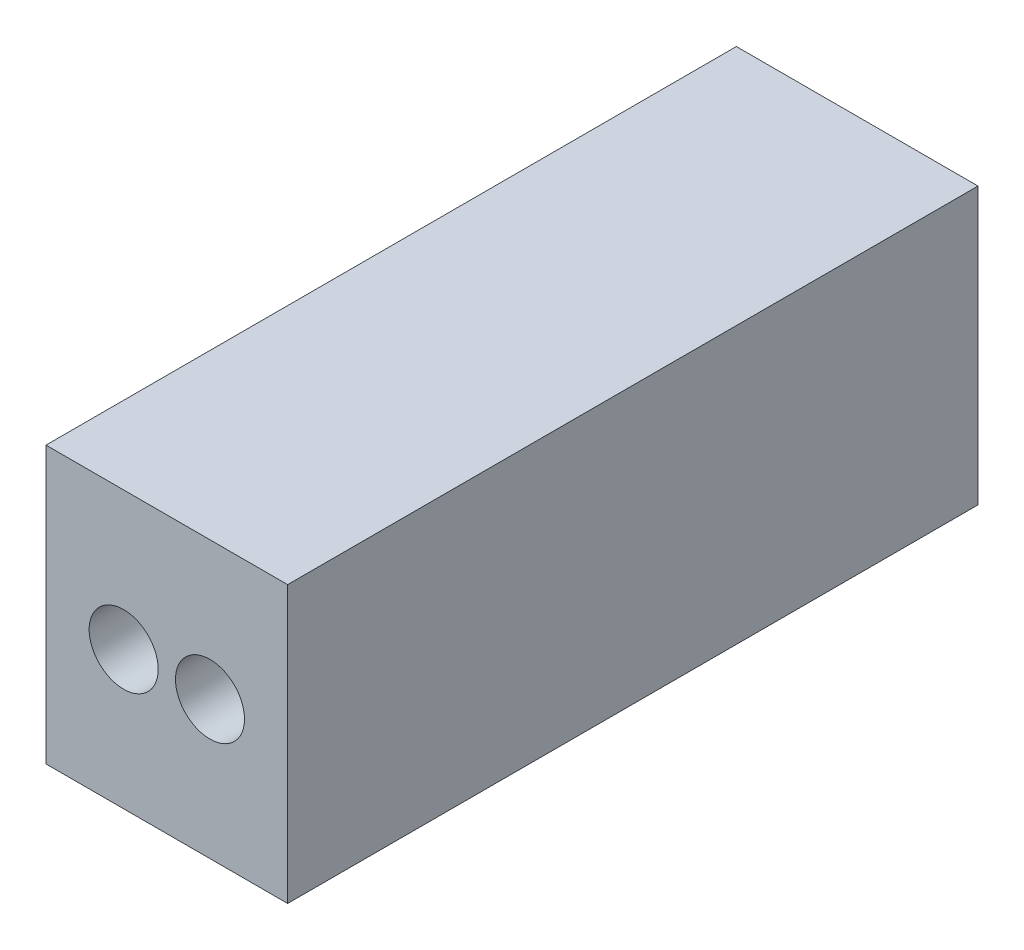
ISO-10303-21;
HEADER;
FILE_DESCRIPTION(('STEP AP214'),'2;1');
FILE_NAME('part.step','',(''),(''),'','','');
FILE_SCHEMA(('AUTOMOTIVE_DESIGN { 1 0 10303 214 1 1 1 1 }'));
ENDSEC;
DATA;
#1=APPLICATION_CONTEXT('core data for automotive mechanical design processes');
#2=APPLICATION_PROTOCOL_DEFINITION('international standard','automotive_design',2000,#1);
#3=PRODUCT_CONTEXT('',#1,'mechanical');
#4=PRODUCT('Part','Part','',(#3));
#5=PRODUCT_RELATED_PRODUCT_CATEGORY('part','',(#4));
#6=PRODUCT_DEFINITION_FORMATION('','',#4);
#7=PRODUCT_DEFINITION_CONTEXT('part definition',#1,'design');
#8=PRODUCT_DEFINITION('design','',#6,#7);
#9=PRODUCT_DEFINITION_SHAPE('','',#8);
#10=(LENGTH_UNIT() NAMED_UNIT(*) SI_UNIT(.MILLI.,.METRE.));
#11=(NAMED_UNIT(*) PLANE_ANGLE_UNIT() SI_UNIT($,.RADIAN.));
#12=(NAMED_UNIT(*) SI_UNIT($,.STERADIAN.) SOLID_ANGLE_UNIT());
#13=UNCERTAINTY_MEASURE_WITH_UNIT(LENGTH_MEASURE(1.E-05),#10,'distance_accuracy_value','');
#14=(GEOMETRIC_REPRESENTATION_CONTEXT(3) GLOBAL_UNCERTAINTY_ASSIGNED_CONTEXT((#13)) GLOBAL_UNIT_ASSIGNED_CONTEXT((#10,
#11,#12)) REPRESENTATION_CONTEXT('',''));
#15=CARTESIAN_POINT('',(0.,0.,0.));
#16=DIRECTION('',(0.,0.,1.));
#17=DIRECTION('',(1.,0.,0.));
#18=AXIS2_PLACEMENT_3D('',#15,#16,#17);
#19=CARTESIAN_POINT('',(0.,0.,10.));
#20=DIRECTION('',(1.,0.,0.));
#21=DIRECTION('',(0.,0.,-1.));
#22=AXIS2_PLACEMENT_3D('',#19,#20,#21);
#23=PLANE('',#22);
#24=DIRECTION('',(0.,-1.,0.));
#25=VECTOR('',#24,1.);
#26=CARTESIAN_POINT('',(0.,0.,0.));
#27=LINE('',#26,#25);
#28=CARTESIAN_POINT('',(0.,4.,0.));
#29=VERTEX_POINT('',#28);
#30=CARTESIAN_POINT('',(0.,0.,0.));
#31=VERTEX_POINT('',#30);
#32=EDGE_CURVE('E99',#29,#31,#27,.T.);
#33=ORIENTED_EDGE('',*,*,#32,.T.);
#34=DIRECTION('',(0.,0.,-1.));
#35=VECTOR('',#34,1.);
#36=CARTESIAN_POINT('',(0.,0.,10.));
#37=LINE('',#36,#35);
#38=CARTESIAN_POINT('',(0.,0.,10.));
#39=VERTEX_POINT('',#38);
#40=EDGE_CURVE('E11',#39,#31,#37,.T.);
#41=ORIENTED_EDGE('',*,*,#40,.F.);
#42=DIRECTION('',(0.,-1.,0.));
#43=VECTOR('',#42,1.);
#44=CARTESIAN_POINT('',(0.,0.,10.));
#45=LINE('',#44,#43);
#46=CARTESIAN_POINT('',(0.,4.,10.));
#47=VERTEX_POINT('',#46);
#48=EDGE_CURVE('E87',#47,#39,#45,.T.);
#49=ORIENTED_EDGE('',*,*,#48,.F.);
#50=DIRECTION('',(0.,0.,-1.));
#51=VECTOR('',#50,1.);
#52=CARTESIAN_POINT('',(0.,4.,10.));
#53=LINE('',#52,#51);
#54=EDGE_CURVE('E95',#47,#29,#53,.T.);
#55=ORIENTED_EDGE('',*,*,#54,.T.);
#56=EDGE_LOOP('',(#33,#41,#49,#55));
#57=FACE_BOUND('',#56,.T.);
#58=ADVANCED_FACE('F36',(#57),#23,.F.);
#59=CARTESIAN_POINT('',(0.,0.,10.));
#60=DIRECTION('',(0.,1.,0.));
#61=DIRECTION('',(0.,0.,1.));
#62=AXIS2_PLACEMENT_3D('',#59,#60,#61);
#63=PLANE('',#62);
#64=DIRECTION('',(1.,0.,0.));
#65=VECTOR('',#64,1.);
#66=CARTESIAN_POINT('',(0.,0.,0.));
#67=LINE('',#66,#65);
#68=CARTESIAN_POINT('',(3.5,0.,0.));
#69=VERTEX_POINT('',#68);
#70=EDGE_CURVE('E91',#31,#69,#67,.T.);
#71=ORIENTED_EDGE('',*,*,#70,.T.);
#72=DIRECTION('',(0.,0.,-1.));
#73=VECTOR('',#72,1.);
#74=CARTESIAN_POINT('',(3.5,0.,10.));
#75=LINE('',#74,#73);
#76=CARTESIAN_POINT('',(3.5,0.,10.));
#77=VERTEX_POINT('',#76);
#78=EDGE_CURVE('E44',#77,#69,#75,.T.);
#79=ORIENTED_EDGE('',*,*,#78,.F.);
#80=DIRECTION('',(1.,0.,0.));
#81=VECTOR('',#80,1.);
#82=CARTESIAN_POINT('',(0.,0.,10.));
#83=LINE('',#82,#81);
#84=EDGE_CURVE('E82',#39,#77,#83,.T.);
#85=ORIENTED_EDGE('',*,*,#84,.F.);
#86=ORIENTED_EDGE('',*,*,#40,.T.);
#87=EDGE_LOOP('',(#71,#79,#85,#86));
#88=FACE_BOUND('',#87,.T.);
#89=ADVANCED_FACE('F90',(#88),#63,.F.);
#90=CARTESIAN_POINT('',(3.5,0.,10.));
#91=DIRECTION('',(-1.,0.,0.));
#92=DIRECTION('',(0.,0.,1.));
#93=AXIS2_PLACEMENT_3D('',#90,#91,#92);
#94=PLANE('',#93);
#95=DIRECTION('',(0.,1.,0.));
#96=VECTOR('',#95,1.);
#97=CARTESIAN_POINT('',(3.5,0.,0.));
#98=LINE('',#97,#96);
#99=CARTESIAN_POINT('',(3.5,4.,0.));
#100=VERTEX_POINT('',#99);
#101=EDGE_CURVE('E69',#69,#100,#98,.T.);
#102=ORIENTED_EDGE('',*,*,#101,.T.);
#103=DIRECTION('',(0.,0.,-1.));
#104=VECTOR('',#103,1.);
#105=CARTESIAN_POINT('',(3.5,4.,10.));
#106=LINE('',#105,#104);
#107=CARTESIAN_POINT('',(3.5,4.,10.));
#108=VERTEX_POINT('',#107);
#109=EDGE_CURVE('E92',#108,#100,#106,.T.);
#110=ORIENTED_EDGE('',*,*,#109,.F.);
#111=DIRECTION('',(0.,1.,0.));
#112=VECTOR('',#111,1.);
#113=CARTESIAN_POINT('',(3.5,0.,10.));
#114=LINE('',#113,#112);
#115=EDGE_CURVE('E85',#77,#108,#114,.T.);
#116=ORIENTED_EDGE('',*,*,#115,.F.);
#117=ORIENTED_EDGE('',*,*,#78,.T.);
#118=EDGE_LOOP('',(#102,#110,#116,#117));
#119=FACE_BOUND('',#118,.T.);
#120=ADVANCED_FACE('F93',(#119),#94,.F.);
#121=CARTESIAN_POINT('',(0.,4.,10.));
#122=DIRECTION('',(0.,-1.,0.));
#123=DIRECTION('',(0.,0.,-1.));
#124=AXIS2_PLACEMENT_3D('',#121,#122,#123);
#125=PLANE('',#124);
#126=DIRECTION('',(-1.,0.,0.));
#127=VECTOR('',#126,1.);
#128=CARTESIAN_POINT('',(0.,4.,0.));
#129=LINE('',#128,#127);
#130=EDGE_CURVE('E75',#100,#29,#129,.T.);
#131=ORIENTED_EDGE('',*,*,#130,.T.);
#132=ORIENTED_EDGE('',*,*,#54,.F.);
#133=DIRECTION('',(-1.,0.,0.));
#134=VECTOR('',#133,1.);
#135=CARTESIAN_POINT('',(0.,4.,10.));
#136=LINE('',#135,#134);
#137=EDGE_CURVE('E52',#108,#47,#136,.T.);
#138=ORIENTED_EDGE('',*,*,#137,.F.);
#139=ORIENTED_EDGE('',*,*,#109,.T.);
#140=EDGE_LOOP('',(#131,#132,#138,#139));
#141=FACE_BOUND('',#140,.T.);
#142=ADVANCED_FACE('F107',(#141),#125,.F.);
#143=CARTESIAN_POINT('',(0.,0.,10.));
#144=DIRECTION('',(0.,0.,-1.));
#145=DIRECTION('',(-1.,0.,0.));
#146=AXIS2_PLACEMENT_3D('',#143,#144,#145);
#147=PLANE('',#146);
#148=CARTESIAN_POINT('',(1.125,2.,10.));
#149=DIRECTION('',(0.,0.,1.));
#150=DIRECTION('',(1.,0.,0.));
#151=AXIS2_PLACEMENT_3D('',#148,#149,#150);
#152=CIRCLE('',#151,0.5);
#153=CARTESIAN_POINT('',(1.625,2.,10.));
#154=VERTEX_POINT('',#153);
#155=EDGE_CURVE('E119',#154,#154,#152,.T.);
#156=ORIENTED_EDGE('',*,*,#155,.F.);
#157=EDGE_LOOP('',(#156));
#158=FACE_BOUND('',#157,.T.);
#159=CARTESIAN_POINT('',(2.375,2.,10.));
#160=DIRECTION('',(0.,0.,1.));
#161=DIRECTION('',(1.,0.,0.));
#162=AXIS2_PLACEMENT_3D('',#159,#160,#161);
#163=CIRCLE('',#162,0.5);
#164=CARTESIAN_POINT('',(2.875,2.,10.));
#165=VERTEX_POINT('',#164);
#166=EDGE_CURVE('E113',#165,#165,#163,.T.);
#167=ORIENTED_EDGE('',*,*,#166,.F.);
#168=EDGE_LOOP('',(#167));
#169=FACE_BOUND('',#168,.T.);
#170=ORIENTED_EDGE('',*,*,#48,.T.);
#171=ORIENTED_EDGE('',*,*,#84,.T.);
#172=ORIENTED_EDGE('',*,*,#115,.T.);
#173=ORIENTED_EDGE('',*,*,#137,.T.);
#174=EDGE_LOOP('',(#170,#171,#172,#173));
#175=FACE_BOUND('',#174,.T.);
#176=ADVANCED_FACE('F83',(#158,#169,#175),#147,.F.);
#177=CARTESIAN_POINT('',(0.,0.,0.));
#178=DIRECTION('',(0.,0.,-1.));
#179=DIRECTION('',(-1.,0.,0.));
#180=AXIS2_PLACEMENT_3D('',#177,#178,#179);
#181=PLANE('',#180);
#182=ORIENTED_EDGE('',*,*,#32,.F.);
#183=ORIENTED_EDGE('',*,*,#130,.F.);
#184=ORIENTED_EDGE('',*,*,#101,.F.);
#185=ORIENTED_EDGE('',*,*,#70,.F.);
#186=EDGE_LOOP('',(#182,#183,#184,#185));
#187=FACE_BOUND('',#186,.T.);
#188=ADVANCED_FACE('F110',(#187),#181,.T.);
#189=CARTESIAN_POINT('',(2.375,2.,5.));
#190=DIRECTION('',(0.,0.,1.));
#191=DIRECTION('',(1.,0.,0.));
#192=AXIS2_PLACEMENT_3D('',#189,#190,#191);
#193=CYLINDRICAL_SURFACE('',#192,0.5);
#194=CARTESIAN_POINT('',(2.375,2.,5.));
#195=DIRECTION('',(0.,0.,1.));
#196=DIRECTION('',(1.,0.,0.));
#197=AXIS2_PLACEMENT_3D('',#194,#195,#196);
#198=CIRCLE('',#197,0.5);
#199=CARTESIAN_POINT('',(2.875,2.,5.));
#200=VERTEX_POINT('',#199);
#201=EDGE_CURVE('E116',#200,#200,#198,.T.);
#202=ORIENTED_EDGE('',*,*,#201,.F.);
#203=EDGE_LOOP('',(#202));
#204=FACE_BOUND('',#203,.T.);
#205=ORIENTED_EDGE('',*,*,#166,.T.);
#206=EDGE_LOOP('',(#205));
#207=FACE_BOUND('',#206,.T.);
#208=ADVANCED_FACE('F139',(#204,#207),#193,.F.);
#209=CARTESIAN_POINT('',(2.375,2.,5.));
#210=DIRECTION('',(0.,0.,1.));
#211=DIRECTION('',(1.,0.,0.));
#212=AXIS2_PLACEMENT_3D('',#209,#210,#211);
#213=PLANE('',#212);
#214=ORIENTED_EDGE('',*,*,#201,.T.);
#215=EDGE_LOOP('',(#214));
#216=FACE_BOUND('',#215,.T.);
#217=ADVANCED_FACE('F130',(#216),#213,.T.);
#218=CARTESIAN_POINT('',(1.125,2.,5.));
#219=DIRECTION('',(0.,0.,1.));
#220=DIRECTION('',(1.,0.,0.));
#221=AXIS2_PLACEMENT_3D('',#218,#219,#220);
#222=CYLINDRICAL_SURFACE('',#221,0.5);
#223=CARTESIAN_POINT('',(1.125,2.,5.));
#224=DIRECTION('',(0.,0.,1.));
#225=DIRECTION('',(1.,0.,0.));
#226=AXIS2_PLACEMENT_3D('',#223,#224,#225);
#227=CIRCLE('',#226,0.5);
#228=CARTESIAN_POINT('',(1.625,2.,5.));
#229=VERTEX_POINT('',#228);
#230=EDGE_CURVE('E102',#229,#229,#227,.T.);
#231=ORIENTED_EDGE('',*,*,#230,.F.);
#232=EDGE_LOOP('',(#231));
#233=FACE_BOUND('',#232,.T.);
#234=ORIENTED_EDGE('',*,*,#155,.T.);
#235=EDGE_LOOP('',(#234));
#236=FACE_BOUND('',#235,.T.);
#237=ADVANCED_FACE('F127',(#233,#236),#222,.F.);
#238=CARTESIAN_POINT('',(1.125,2.,5.));
#239=DIRECTION('',(0.,0.,1.));
#240=DIRECTION('',(1.,0.,0.));
#241=AXIS2_PLACEMENT_3D('',#238,#239,#240);
#242=PLANE('',#241);
#243=ORIENTED_EDGE('',*,*,#230,.T.);
#244=EDGE_LOOP('',(#243));
#245=FACE_BOUND('',#244,.T.);
#246=ADVANCED_FACE('F125',(#245),#242,.T.);
#247=CLOSED_SHELL('',(#58,#89,#120,#142,#176,#188,#208,#217,#237,#246));
#248=MANIFOLD_SOLID_BREP('B2',#247);
#249=ADVANCED_BREP_SHAPE_REPRESENTATION('',(#18,#248),#14);
#250=SHAPE_DEFINITION_REPRESENTATION(#9,#249);
ENDSEC;
END-ISO-10303-21;
